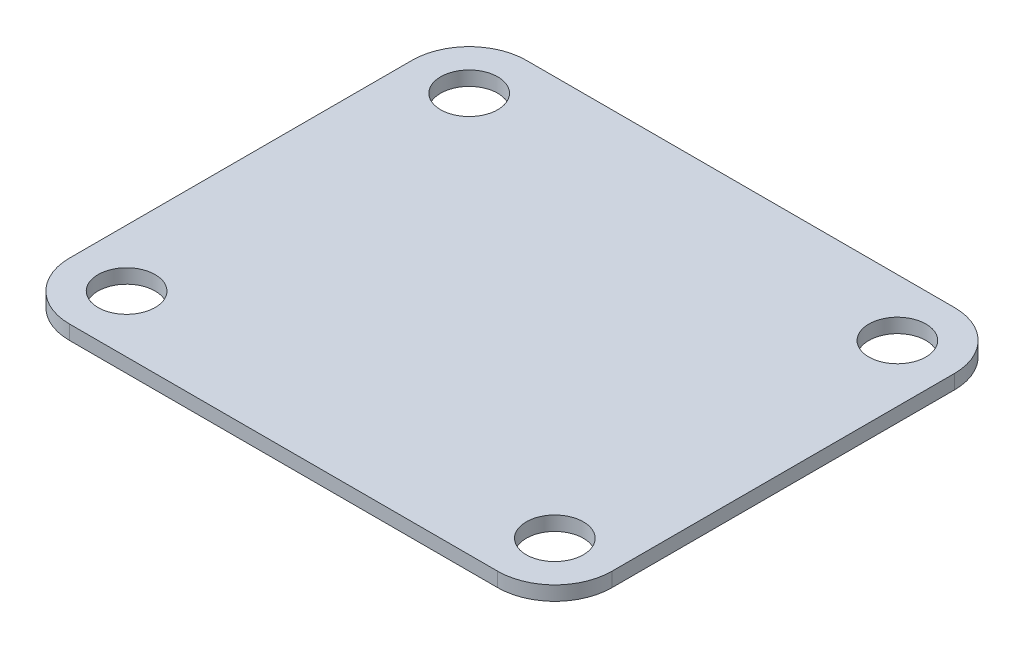
ISO-10303-21;
HEADER;
FILE_DESCRIPTION(('STEP AP214'),'2;1');
FILE_NAME('part.step','',(''),(''),'','','');
FILE_SCHEMA(('AUTOMOTIVE_DESIGN { 1 0 10303 214 1 1 1 1 }'));
ENDSEC;
DATA;
#1=APPLICATION_CONTEXT('core data for automotive mechanical design processes');
#2=APPLICATION_PROTOCOL_DEFINITION('international standard','automotive_design',2000,#1);
#3=PRODUCT_CONTEXT('',#1,'mechanical');
#4=PRODUCT('Part','Part','',(#3));
#5=PRODUCT_RELATED_PRODUCT_CATEGORY('part','',(#4));
#6=PRODUCT_DEFINITION_FORMATION('','',#4);
#7=PRODUCT_DEFINITION_CONTEXT('part definition',#1,'design');
#8=PRODUCT_DEFINITION('design','',#6,#7);
#9=PRODUCT_DEFINITION_SHAPE('','',#8);
#10=(LENGTH_UNIT() NAMED_UNIT(*) SI_UNIT(.MILLI.,.METRE.));
#11=(NAMED_UNIT(*) PLANE_ANGLE_UNIT() SI_UNIT($,.RADIAN.));
#12=(NAMED_UNIT(*) SI_UNIT($,.STERADIAN.) SOLID_ANGLE_UNIT());
#13=UNCERTAINTY_MEASURE_WITH_UNIT(LENGTH_MEASURE(1.E-05),#10,'distance_accuracy_value','');
#14=(GEOMETRIC_REPRESENTATION_CONTEXT(3) GLOBAL_UNCERTAINTY_ASSIGNED_CONTEXT((#13)) GLOBAL_UNIT_ASSIGNED_CONTEXT((#10,
#11,#12)) REPRESENTATION_CONTEXT('',''));
#15=CARTESIAN_POINT('',(0.,0.,0.));
#16=DIRECTION('',(0.,0.,1.));
#17=DIRECTION('',(1.,0.,0.));
#18=AXIS2_PLACEMENT_3D('',#15,#16,#17);
#19=CARTESIAN_POINT('',(0.,1.,0.));
#20=DIRECTION('',(0.,1.,0.));
#21=DIRECTION('',(0.,0.,1.));
#22=AXIS2_PLACEMENT_3D('',#19,#20,#21);
#23=PLANE('',#22);
#24=CARTESIAN_POINT('',(15.,1.,12.));
#25=DIRECTION('',(0.,1.,0.));
#26=DIRECTION('',(0.,0.,1.));
#27=AXIS2_PLACEMENT_3D('',#24,#25,#26);
#28=CIRCLE('',#27,2.);
#29=CARTESIAN_POINT('',(15.,1.,14.));
#30=VERTEX_POINT('',#29);
#31=EDGE_CURVE('E215',#30,#30,#28,.T.);
#32=ORIENTED_EDGE('',*,*,#31,.F.);
#33=EDGE_LOOP('',(#32));
#34=FACE_BOUND('',#33,.T.);
#35=CARTESIAN_POINT('',(-15.,1.,-12.));
#36=DIRECTION('',(0.,1.,0.));
#37=DIRECTION('',(0.,0.,1.));
#38=AXIS2_PLACEMENT_3D('',#35,#36,#37);
#39=CIRCLE('',#38,2.);
#40=CARTESIAN_POINT('',(-15.,1.,-10.));
#41=VERTEX_POINT('',#40);
#42=EDGE_CURVE('E130',#41,#41,#39,.T.);
#43=ORIENTED_EDGE('',*,*,#42,.F.);
#44=EDGE_LOOP('',(#43));
#45=FACE_BOUND('',#44,.T.);
#46=DIRECTION('',(-1.,0.,0.));
#47=VECTOR('',#46,1.);
#48=CARTESIAN_POINT('',(19.,1.,-16.));
#49=LINE('',#48,#47);
#50=CARTESIAN_POINT('',(15.,1.,-16.));
#51=VERTEX_POINT('',#50);
#52=CARTESIAN_POINT('',(-15.,1.,-16.));
#53=VERTEX_POINT('',#52);
#54=EDGE_CURVE('E139',#51,#53,#49,.T.);
#55=ORIENTED_EDGE('',*,*,#54,.T.);
#56=CARTESIAN_POINT('',(-15.,1.,-12.));
#57=DIRECTION('',(0.,1.,0.));
#58=DIRECTION('',(0.,0.,1.));
#59=AXIS2_PLACEMENT_3D('',#56,#57,#58);
#60=CIRCLE('',#59,4.);
#61=CARTESIAN_POINT('',(-19.,1.,-12.));
#62=VERTEX_POINT('',#61);
#63=EDGE_CURVE('E158',#53,#62,#60,.T.);
#64=ORIENTED_EDGE('',*,*,#63,.T.);
#65=DIRECTION('',(0.,0.,1.));
#66=VECTOR('',#65,1.);
#67=CARTESIAN_POINT('',(-19.,1.,16.));
#68=LINE('',#67,#66);
#69=CARTESIAN_POINT('',(-19.,1.,12.));
#70=VERTEX_POINT('',#69);
#71=EDGE_CURVE('E122',#62,#70,#68,.T.);
#72=ORIENTED_EDGE('',*,*,#71,.T.);
#73=CARTESIAN_POINT('',(-15.,1.,12.));
#74=DIRECTION('',(0.,1.,0.));
#75=DIRECTION('',(0.,0.,1.));
#76=AXIS2_PLACEMENT_3D('',#73,#74,#75);
#77=CIRCLE('',#76,4.);
#78=CARTESIAN_POINT('',(-15.,1.,16.));
#79=VERTEX_POINT('',#78);
#80=EDGE_CURVE('E153',#70,#79,#77,.T.);
#81=ORIENTED_EDGE('',*,*,#80,.T.);
#82=DIRECTION('',(1.,0.,0.));
#83=VECTOR('',#82,1.);
#84=CARTESIAN_POINT('',(19.,1.,16.));
#85=LINE('',#84,#83);
#86=CARTESIAN_POINT('',(15.,1.,16.));
#87=VERTEX_POINT('',#86);
#88=EDGE_CURVE('E229',#79,#87,#85,.T.);
#89=ORIENTED_EDGE('',*,*,#88,.T.);
#90=CARTESIAN_POINT('',(15.,1.,12.));
#91=DIRECTION('',(0.,1.,0.));
#92=DIRECTION('',(0.,0.,1.));
#93=AXIS2_PLACEMENT_3D('',#90,#91,#92);
#94=CIRCLE('',#93,4.);
#95=CARTESIAN_POINT('',(19.,1.,12.));
#96=VERTEX_POINT('',#95);
#97=EDGE_CURVE('E57',#87,#96,#94,.T.);
#98=ORIENTED_EDGE('',*,*,#97,.T.);
#99=DIRECTION('',(0.,0.,-1.));
#100=VECTOR('',#99,1.);
#101=CARTESIAN_POINT('',(19.,1.,16.));
#102=LINE('',#101,#100);
#103=CARTESIAN_POINT('',(19.,1.,-12.));
#104=VERTEX_POINT('',#103);
#105=EDGE_CURVE('E230',#96,#104,#102,.T.);
#106=ORIENTED_EDGE('',*,*,#105,.T.);
#107=CARTESIAN_POINT('',(15.,1.,-12.));
#108=DIRECTION('',(0.,1.,0.));
#109=DIRECTION('',(0.,0.,1.));
#110=AXIS2_PLACEMENT_3D('',#107,#108,#109);
#111=CIRCLE('',#110,4.);
#112=EDGE_CURVE('E156',#104,#51,#111,.T.);
#113=ORIENTED_EDGE('',*,*,#112,.T.);
#114=EDGE_LOOP('',(#55,#64,#72,#81,#89,#98,#106,#113));
#115=FACE_BOUND('',#114,.T.);
#116=CARTESIAN_POINT('',(15.,1.,-12.));
#117=DIRECTION('',(0.,1.,0.));
#118=DIRECTION('',(0.,0.,-1.));
#119=AXIS2_PLACEMENT_3D('',#116,#117,#118);
#120=CIRCLE('',#119,2.);
#121=CARTESIAN_POINT('',(15.,1.,-14.));
#122=VERTEX_POINT('',#121);
#123=EDGE_CURVE('E221',#122,#122,#120,.T.);
#124=ORIENTED_EDGE('',*,*,#123,.F.);
#125=EDGE_LOOP('',(#124));
#126=FACE_BOUND('',#125,.T.);
#127=CARTESIAN_POINT('',(-15.,1.,12.));
#128=DIRECTION('',(0.,1.,0.));
#129=DIRECTION('',(0.,0.,-1.));
#130=AXIS2_PLACEMENT_3D('',#127,#128,#129);
#131=CIRCLE('',#130,2.);
#132=CARTESIAN_POINT('',(-15.,1.,9.99999999999999));
#133=VERTEX_POINT('',#132);
#134=EDGE_CURVE('E209',#133,#133,#131,.T.);
#135=ORIENTED_EDGE('',*,*,#134,.F.);
#136=EDGE_LOOP('',(#135));
#137=FACE_BOUND('',#136,.T.);
#138=ADVANCED_FACE('F35',(#34,#45,#115,#126,#137),#23,.T.);
#139=CARTESIAN_POINT('',(0.,0.,0.));
#140=DIRECTION('',(0.,1.,0.));
#141=DIRECTION('',(0.,0.,1.));
#142=AXIS2_PLACEMENT_3D('',#139,#140,#141);
#143=PLANE('',#142);
#144=CARTESIAN_POINT('',(0.,0.,0.));
#145=DIRECTION('',(0.,1.,0.));
#146=DIRECTION('',(0.,0.,1.));
#147=AXIS2_PLACEMENT_3D('',#144,#145,#146);
#148=CIRCLE('',#147,15.);
#149=CARTESIAN_POINT('',(0.,0.,15.));
#150=VERTEX_POINT('',#149);
#151=EDGE_CURVE('E172',#150,#150,#148,.T.);
#152=ORIENTED_EDGE('',*,*,#151,.T.);
#153=EDGE_LOOP('',(#152));
#154=FACE_BOUND('',#153,.T.);
#155=DIRECTION('',(0.,0.,1.));
#156=VECTOR('',#155,1.);
#157=CARTESIAN_POINT('',(-19.,0.,16.));
#158=LINE('',#157,#156);
#159=CARTESIAN_POINT('',(-19.,0.,-12.));
#160=VERTEX_POINT('',#159);
#161=CARTESIAN_POINT('',(-19.,0.,12.));
#162=VERTEX_POINT('',#161);
#163=EDGE_CURVE('E119',#160,#162,#158,.T.);
#164=ORIENTED_EDGE('',*,*,#163,.F.);
#165=CARTESIAN_POINT('',(-15.,0.,-12.));
#166=DIRECTION('',(0.,1.,0.));
#167=DIRECTION('',(0.,0.,1.));
#168=AXIS2_PLACEMENT_3D('',#165,#166,#167);
#169=CIRCLE('',#168,4.);
#170=CARTESIAN_POINT('',(-15.,0.,-16.));
#171=VERTEX_POINT('',#170);
#172=EDGE_CURVE('E102',#160,#171,#169,.F.);
#173=ORIENTED_EDGE('',*,*,#172,.T.);
#174=DIRECTION('',(-1.,0.,0.));
#175=VECTOR('',#174,1.);
#176=CARTESIAN_POINT('',(19.,0.,-16.));
#177=LINE('',#176,#175);
#178=CARTESIAN_POINT('',(15.,0.,-16.));
#179=VERTEX_POINT('',#178);
#180=EDGE_CURVE('E143',#179,#171,#177,.T.);
#181=ORIENTED_EDGE('',*,*,#180,.F.);
#182=CARTESIAN_POINT('',(15.,0.,-12.));
#183=DIRECTION('',(0.,1.,0.));
#184=DIRECTION('',(0.,0.,1.));
#185=AXIS2_PLACEMENT_3D('',#182,#183,#184);
#186=CIRCLE('',#185,4.);
#187=CARTESIAN_POINT('',(19.,0.,-12.));
#188=VERTEX_POINT('',#187);
#189=EDGE_CURVE('E113',#179,#188,#186,.F.);
#190=ORIENTED_EDGE('',*,*,#189,.T.);
#191=DIRECTION('',(0.,0.,-1.));
#192=VECTOR('',#191,1.);
#193=CARTESIAN_POINT('',(19.,0.,16.));
#194=LINE('',#193,#192);
#195=CARTESIAN_POINT('',(19.,0.,12.));
#196=VERTEX_POINT('',#195);
#197=EDGE_CURVE('E133',#196,#188,#194,.T.);
#198=ORIENTED_EDGE('',*,*,#197,.F.);
#199=CARTESIAN_POINT('',(15.,0.,12.));
#200=DIRECTION('',(0.,1.,0.));
#201=DIRECTION('',(0.,0.,1.));
#202=AXIS2_PLACEMENT_3D('',#199,#200,#201);
#203=CIRCLE('',#202,4.);
#204=CARTESIAN_POINT('',(15.,0.,16.));
#205=VERTEX_POINT('',#204);
#206=EDGE_CURVE('E147',#196,#205,#203,.F.);
#207=ORIENTED_EDGE('',*,*,#206,.T.);
#208=DIRECTION('',(1.,0.,0.));
#209=VECTOR('',#208,1.);
#210=CARTESIAN_POINT('',(19.,0.,16.));
#211=LINE('',#210,#209);
#212=CARTESIAN_POINT('',(-15.,0.,16.));
#213=VERTEX_POINT('',#212);
#214=EDGE_CURVE('E129',#213,#205,#211,.T.);
#215=ORIENTED_EDGE('',*,*,#214,.F.);
#216=CARTESIAN_POINT('',(-15.,0.,12.));
#217=DIRECTION('',(0.,1.,0.));
#218=DIRECTION('',(0.,0.,1.));
#219=AXIS2_PLACEMENT_3D('',#216,#217,#218);
#220=CIRCLE('',#219,4.);
#221=EDGE_CURVE('E123',#213,#162,#220,.F.);
#222=ORIENTED_EDGE('',*,*,#221,.T.);
#223=EDGE_LOOP('',(#164,#173,#181,#190,#198,#207,#215,#222));
#224=FACE_BOUND('',#223,.T.);
#225=CARTESIAN_POINT('',(-15.,0.,-12.));
#226=DIRECTION('',(0.,1.,0.));
#227=DIRECTION('',(0.,0.,1.));
#228=AXIS2_PLACEMENT_3D('',#225,#226,#227);
#229=CIRCLE('',#228,2.);
#230=CARTESIAN_POINT('',(-15.,0.,-10.));
#231=VERTEX_POINT('',#230);
#232=EDGE_CURVE('E136',#231,#231,#229,.T.);
#233=ORIENTED_EDGE('',*,*,#232,.T.);
#234=EDGE_LOOP('',(#233));
#235=FACE_BOUND('',#234,.T.);
#236=CARTESIAN_POINT('',(15.,0.,-12.));
#237=DIRECTION('',(0.,1.,0.));
#238=DIRECTION('',(0.,0.,-1.));
#239=AXIS2_PLACEMENT_3D('',#236,#237,#238);
#240=CIRCLE('',#239,2.);
#241=CARTESIAN_POINT('',(15.,0.,-14.));
#242=VERTEX_POINT('',#241);
#243=EDGE_CURVE('E218',#242,#242,#240,.T.);
#244=ORIENTED_EDGE('',*,*,#243,.T.);
#245=EDGE_LOOP('',(#244));
#246=FACE_BOUND('',#245,.T.);
#247=CARTESIAN_POINT('',(15.,0.,12.));
#248=DIRECTION('',(0.,1.,0.));
#249=DIRECTION('',(0.,0.,1.));
#250=AXIS2_PLACEMENT_3D('',#247,#248,#249);
#251=CIRCLE('',#250,2.);
#252=CARTESIAN_POINT('',(15.,0.,14.));
#253=VERTEX_POINT('',#252);
#254=EDGE_CURVE('E212',#253,#253,#251,.T.);
#255=ORIENTED_EDGE('',*,*,#254,.T.);
#256=EDGE_LOOP('',(#255));
#257=FACE_BOUND('',#256,.T.);
#258=CARTESIAN_POINT('',(-15.,0.,12.));
#259=DIRECTION('',(0.,1.,0.));
#260=DIRECTION('',(0.,0.,-1.));
#261=AXIS2_PLACEMENT_3D('',#258,#259,#260);
#262=CIRCLE('',#261,2.);
#263=CARTESIAN_POINT('',(-15.,0.,9.99999999999999));
#264=VERTEX_POINT('',#263);
#265=EDGE_CURVE('E208',#264,#264,#262,.T.);
#266=ORIENTED_EDGE('',*,*,#265,.T.);
#267=EDGE_LOOP('',(#266));
#268=FACE_BOUND('',#267,.T.);
#269=ADVANCED_FACE('F126',(#154,#224,#235,#246,#257,#268),#143,.F.);
#270=CARTESIAN_POINT('',(-19.,1.,16.));
#271=DIRECTION('',(1.,0.,0.));
#272=DIRECTION('',(0.,0.,-1.));
#273=AXIS2_PLACEMENT_3D('',#270,#271,#272);
#274=PLANE('',#273);
#275=ORIENTED_EDGE('',*,*,#71,.F.);
#276=DIRECTION('',(0.,-1.,0.));
#277=VECTOR('',#276,1.);
#278=CARTESIAN_POINT('',(-19.,1.,-12.));
#279=LINE('',#278,#277);
#280=EDGE_CURVE('E106',#62,#160,#279,.T.);
#281=ORIENTED_EDGE('',*,*,#280,.T.);
#282=ORIENTED_EDGE('',*,*,#163,.T.);
#283=DIRECTION('',(0.,-1.,0.));
#284=VECTOR('',#283,1.);
#285=CARTESIAN_POINT('',(-19.,1.,12.));
#286=LINE('',#285,#284);
#287=EDGE_CURVE('E124',#162,#70,#286,.F.);
#288=ORIENTED_EDGE('',*,*,#287,.T.);
#289=EDGE_LOOP('',(#275,#281,#282,#288));
#290=FACE_BOUND('',#289,.T.);
#291=ADVANCED_FACE('F118',(#290),#274,.F.);
#292=CARTESIAN_POINT('',(19.,1.,16.));
#293=DIRECTION('',(0.,0.,-1.));
#294=DIRECTION('',(-1.,0.,0.));
#295=AXIS2_PLACEMENT_3D('',#292,#293,#294);
#296=PLANE('',#295);
#297=ORIENTED_EDGE('',*,*,#214,.T.);
#298=DIRECTION('',(0.,-1.,0.));
#299=VECTOR('',#298,1.);
#300=CARTESIAN_POINT('',(15.,1.,16.));
#301=LINE('',#300,#299);
#302=EDGE_CURVE('E167',#205,#87,#301,.F.);
#303=ORIENTED_EDGE('',*,*,#302,.T.);
#304=ORIENTED_EDGE('',*,*,#88,.F.);
#305=DIRECTION('',(0.,-1.,0.));
#306=VECTOR('',#305,1.);
#307=CARTESIAN_POINT('',(-15.,1.,16.));
#308=LINE('',#307,#306);
#309=EDGE_CURVE('E164',#79,#213,#308,.T.);
#310=ORIENTED_EDGE('',*,*,#309,.T.);
#311=EDGE_LOOP('',(#297,#303,#304,#310));
#312=FACE_BOUND('',#311,.T.);
#313=ADVANCED_FACE('F247',(#312),#296,.F.);
#314=CARTESIAN_POINT('',(19.,1.,16.));
#315=DIRECTION('',(-1.,0.,0.));
#316=DIRECTION('',(0.,0.,1.));
#317=AXIS2_PLACEMENT_3D('',#314,#315,#316);
#318=PLANE('',#317);
#319=ORIENTED_EDGE('',*,*,#197,.T.);
#320=DIRECTION('',(0.,-1.,0.));
#321=VECTOR('',#320,1.);
#322=CARTESIAN_POINT('',(19.,1.,-12.));
#323=LINE('',#322,#321);
#324=EDGE_CURVE('E50',#188,#104,#323,.F.);
#325=ORIENTED_EDGE('',*,*,#324,.T.);
#326=ORIENTED_EDGE('',*,*,#105,.F.);
#327=DIRECTION('',(0.,-1.,0.));
#328=VECTOR('',#327,1.);
#329=CARTESIAN_POINT('',(19.,1.,12.));
#330=LINE('',#329,#328);
#331=EDGE_CURVE('E160',#96,#196,#330,.T.);
#332=ORIENTED_EDGE('',*,*,#331,.T.);
#333=EDGE_LOOP('',(#319,#325,#326,#332));
#334=FACE_BOUND('',#333,.T.);
#335=ADVANCED_FACE('F241',(#334),#318,.F.);
#336=CARTESIAN_POINT('',(19.,1.,-16.));
#337=DIRECTION('',(0.,0.,1.));
#338=DIRECTION('',(1.,0.,0.));
#339=AXIS2_PLACEMENT_3D('',#336,#337,#338);
#340=PLANE('',#339);
#341=ORIENTED_EDGE('',*,*,#180,.T.);
#342=DIRECTION('',(0.,-1.,0.));
#343=VECTOR('',#342,1.);
#344=CARTESIAN_POINT('',(-15.,1.,-16.));
#345=LINE('',#344,#343);
#346=EDGE_CURVE('E107',#171,#53,#345,.F.);
#347=ORIENTED_EDGE('',*,*,#346,.T.);
#348=ORIENTED_EDGE('',*,*,#54,.F.);
#349=DIRECTION('',(0.,-1.,0.));
#350=VECTOR('',#349,1.);
#351=CARTESIAN_POINT('',(15.,1.,-16.));
#352=LINE('',#351,#350);
#353=EDGE_CURVE('E112',#51,#179,#352,.T.);
#354=ORIENTED_EDGE('',*,*,#353,.T.);
#355=EDGE_LOOP('',(#341,#347,#348,#354));
#356=FACE_BOUND('',#355,.T.);
#357=ADVANCED_FACE('F237',(#356),#340,.F.);
#358=CARTESIAN_POINT('',(-15.,1.,-12.));
#359=DIRECTION('',(0.,-1.,0.));
#360=DIRECTION('',(0.,0.,-1.));
#361=AXIS2_PLACEMENT_3D('',#358,#359,#360);
#362=CYLINDRICAL_SURFACE('',#361,2.);
#363=ORIENTED_EDGE('',*,*,#42,.T.);
#364=EDGE_LOOP('',(#363));
#365=FACE_BOUND('',#364,.T.);
#366=ORIENTED_EDGE('',*,*,#232,.F.);
#367=EDGE_LOOP('',(#366));
#368=FACE_BOUND('',#367,.T.);
#369=ADVANCED_FACE('F276',(#365,#368),#362,.F.);
#370=CARTESIAN_POINT('',(15.,1.,-12.));
#371=DIRECTION('',(0.,-1.,0.));
#372=DIRECTION('',(0.,0.,-1.));
#373=AXIS2_PLACEMENT_3D('',#370,#371,#372);
#374=CYLINDRICAL_SURFACE('',#373,2.);
#375=ORIENTED_EDGE('',*,*,#123,.T.);
#376=EDGE_LOOP('',(#375));
#377=FACE_BOUND('',#376,.T.);
#378=ORIENTED_EDGE('',*,*,#243,.F.);
#379=EDGE_LOOP('',(#378));
#380=FACE_BOUND('',#379,.T.);
#381=ADVANCED_FACE('F432',(#377,#380),#374,.F.);
#382=CARTESIAN_POINT('',(15.,1.,12.));
#383=DIRECTION('',(0.,-1.,0.));
#384=DIRECTION('',(0.,0.,-1.));
#385=AXIS2_PLACEMENT_3D('',#382,#383,#384);
#386=CYLINDRICAL_SURFACE('',#385,2.);
#387=ORIENTED_EDGE('',*,*,#31,.T.);
#388=EDGE_LOOP('',(#387));
#389=FACE_BOUND('',#388,.T.);
#390=ORIENTED_EDGE('',*,*,#254,.F.);
#391=EDGE_LOOP('',(#390));
#392=FACE_BOUND('',#391,.T.);
#393=ADVANCED_FACE('F429',(#389,#392),#386,.F.);
#394=CARTESIAN_POINT('',(-15.,1.,12.));
#395=DIRECTION('',(0.,-1.,0.));
#396=DIRECTION('',(0.,0.,-1.));
#397=AXIS2_PLACEMENT_3D('',#394,#395,#396);
#398=CYLINDRICAL_SURFACE('',#397,2.);
#399=ORIENTED_EDGE('',*,*,#134,.T.);
#400=EDGE_LOOP('',(#399));
#401=FACE_BOUND('',#400,.T.);
#402=ORIENTED_EDGE('',*,*,#265,.F.);
#403=EDGE_LOOP('',(#402));
#404=FACE_BOUND('',#403,.T.);
#405=ADVANCED_FACE('F289',(#401,#404),#398,.F.);
#406=CARTESIAN_POINT('',(-15.,1.,-12.));
#407=DIRECTION('',(0.,-1.,0.));
#408=DIRECTION('',(0.,0.,-1.));
#409=AXIS2_PLACEMENT_3D('',#406,#407,#408);
#410=CYLINDRICAL_SURFACE('',#409,4.);
#411=ORIENTED_EDGE('',*,*,#63,.F.);
#412=ORIENTED_EDGE('',*,*,#346,.F.);
#413=ORIENTED_EDGE('',*,*,#172,.F.);
#414=ORIENTED_EDGE('',*,*,#280,.F.);
#415=EDGE_LOOP('',(#411,#412,#413,#414));
#416=FACE_BOUND('',#415,.T.);
#417=ADVANCED_FACE('F105',(#416),#410,.T.);
#418=CARTESIAN_POINT('',(15.,1.,-12.));
#419=DIRECTION('',(0.,-1.,0.));
#420=DIRECTION('',(0.,0.,-1.));
#421=AXIS2_PLACEMENT_3D('',#418,#419,#420);
#422=CYLINDRICAL_SURFACE('',#421,4.);
#423=ORIENTED_EDGE('',*,*,#112,.F.);
#424=ORIENTED_EDGE('',*,*,#324,.F.);
#425=ORIENTED_EDGE('',*,*,#189,.F.);
#426=ORIENTED_EDGE('',*,*,#353,.F.);
#427=EDGE_LOOP('',(#423,#424,#425,#426));
#428=FACE_BOUND('',#427,.T.);
#429=ADVANCED_FACE('F239',(#428),#422,.T.);
#430=CARTESIAN_POINT('',(15.,1.,12.));
#431=DIRECTION('',(0.,-1.,0.));
#432=DIRECTION('',(0.,0.,-1.));
#433=AXIS2_PLACEMENT_3D('',#430,#431,#432);
#434=CYLINDRICAL_SURFACE('',#433,4.);
#435=ORIENTED_EDGE('',*,*,#97,.F.);
#436=ORIENTED_EDGE('',*,*,#302,.F.);
#437=ORIENTED_EDGE('',*,*,#206,.F.);
#438=ORIENTED_EDGE('',*,*,#331,.F.);
#439=EDGE_LOOP('',(#435,#436,#437,#438));
#440=FACE_BOUND('',#439,.T.);
#441=ADVANCED_FACE('F244',(#440),#434,.T.);
#442=CARTESIAN_POINT('',(-15.,1.,12.));
#443=DIRECTION('',(0.,-1.,0.));
#444=DIRECTION('',(0.,0.,-1.));
#445=AXIS2_PLACEMENT_3D('',#442,#443,#444);
#446=CYLINDRICAL_SURFACE('',#445,4.);
#447=ORIENTED_EDGE('',*,*,#80,.F.);
#448=ORIENTED_EDGE('',*,*,#287,.F.);
#449=ORIENTED_EDGE('',*,*,#221,.F.);
#450=ORIENTED_EDGE('',*,*,#309,.F.);
#451=EDGE_LOOP('',(#447,#448,#449,#450));
#452=FACE_BOUND('',#451,.T.);
#453=ADVANCED_FACE('F252',(#452),#446,.T.);
#454=CARTESIAN_POINT('',(0.,-3.,0.));
#455=DIRECTION('',(0.,1.,0.));
#456=DIRECTION('',(0.,0.,1.));
#457=AXIS2_PLACEMENT_3D('',#454,#455,#456);
#458=CYLINDRICAL_SURFACE('',#457,13.);
#459=CARTESIAN_POINT('',(0.,-2.,0.));
#460=DIRECTION('',(0.,1.,0.));
#461=DIRECTION('',(0.,0.,1.));
#462=AXIS2_PLACEMENT_3D('',#459,#460,#461);
#463=CIRCLE('',#462,13.);
#464=CARTESIAN_POINT('',(0.,-2.,13.));
#465=VERTEX_POINT('',#464);
#466=EDGE_CURVE('E169',#465,#465,#463,.F.);
#467=ORIENTED_EDGE('',*,*,#466,.T.);
#468=EDGE_LOOP('',(#467));
#469=FACE_BOUND('',#468,.T.);
#470=CARTESIAN_POINT('',(0.,-3.,0.));
#471=DIRECTION('',(0.,-1.,0.));
#472=DIRECTION('',(0.,0.,-1.));
#473=AXIS2_PLACEMENT_3D('',#470,#471,#472);
#474=CIRCLE('',#473,13.);
#475=CARTESIAN_POINT('',(0.,-3.,-13.));
#476=VERTEX_POINT('',#475);
#477=EDGE_CURVE('E201',#476,#476,#474,.T.);
#478=ORIENTED_EDGE('',*,*,#477,.F.);
#479=EDGE_LOOP('',(#478));
#480=FACE_BOUND('',#479,.T.);
#481=ADVANCED_FACE('F254',(#469,#480),#458,.T.);
#482=CARTESIAN_POINT('',(0.,-3.,0.));
#483=DIRECTION('',(0.,-1.,0.));
#484=DIRECTION('',(0.,0.,-1.));
#485=AXIS2_PLACEMENT_3D('',#482,#483,#484);
#486=PLANE('',#485);
#487=CARTESIAN_POINT('',(0.,-3.,0.));
#488=DIRECTION('',(0.,-1.,0.));
#489=DIRECTION('',(0.,0.,-1.));
#490=AXIS2_PLACEMENT_3D('',#487,#488,#489);
#491=CIRCLE('',#490,12.);
#492=CARTESIAN_POINT('',(0.,-3.,-12.));
#493=VERTEX_POINT('',#492);
#494=EDGE_CURVE('E197',#493,#493,#491,.T.);
#495=ORIENTED_EDGE('',*,*,#494,.F.);
#496=EDGE_LOOP('',(#495));
#497=FACE_BOUND('',#496,.T.);
#498=ORIENTED_EDGE('',*,*,#477,.T.);
#499=EDGE_LOOP('',(#498));
#500=FACE_BOUND('',#499,.T.);
#501=ADVANCED_FACE('F260',(#497,#500),#486,.T.);
#502=CARTESIAN_POINT('',(0.,-1.,0.));
#503=DIRECTION('',(0.,-1.,0.));
#504=DIRECTION('',(0.,0.,-1.));
#505=AXIS2_PLACEMENT_3D('',#502,#503,#504);
#506=CYLINDRICAL_SURFACE('',#505,12.);
#507=CARTESIAN_POINT('',(0.,-2.,0.));
#508=DIRECTION('',(0.,-1.,0.));
#509=DIRECTION('',(0.,0.,-1.));
#510=AXIS2_PLACEMENT_3D('',#507,#508,#509);
#511=CIRCLE('',#510,12.);
#512=CARTESIAN_POINT('',(0.,-2.,-12.));
#513=VERTEX_POINT('',#512);
#514=EDGE_CURVE('E11',#513,#513,#511,.F.);
#515=ORIENTED_EDGE('',*,*,#514,.T.);
#516=EDGE_LOOP('',(#515));
#517=FACE_BOUND('',#516,.T.);
#518=ORIENTED_EDGE('',*,*,#494,.T.);
#519=EDGE_LOOP('',(#518));
#520=FACE_BOUND('',#519,.T.);
#521=ADVANCED_FACE('F314',(#517,#520),#506,.F.);
#522=CARTESIAN_POINT('',(0.,-1.,0.));
#523=DIRECTION('',(0.,-1.,0.));
#524=DIRECTION('',(0.,0.,-1.));
#525=AXIS2_PLACEMENT_3D('',#522,#523,#524);
#526=PLANE('',#525);
#527=CARTESIAN_POINT('',(0.,-1.,0.));
#528=DIRECTION('',(0.,-1.,0.));
#529=DIRECTION('',(0.,0.,-1.));
#530=AXIS2_PLACEMENT_3D('',#527,#528,#529);
#531=CIRCLE('',#530,7.);
#532=CARTESIAN_POINT('',(0.,-1.,-7.));
#533=VERTEX_POINT('',#532);
#534=EDGE_CURVE('E43',#533,#533,#531,.F.);
#535=ORIENTED_EDGE('',*,*,#534,.T.);
#536=EDGE_LOOP('',(#535));
#537=FACE_BOUND('',#536,.T.);
#538=CARTESIAN_POINT('',(0.,-1.,0.));
#539=DIRECTION('',(0.,-1.,0.));
#540=DIRECTION('',(0.,0.,-1.));
#541=AXIS2_PLACEMENT_3D('',#538,#539,#540);
#542=CIRCLE('',#541,11.);
#543=CARTESIAN_POINT('',(0.,-1.,-11.));
#544=VERTEX_POINT('',#543);
#545=EDGE_CURVE('E181',#544,#544,#542,.T.);
#546=ORIENTED_EDGE('',*,*,#545,.T.);
#547=EDGE_LOOP('',(#546));
#548=FACE_BOUND('',#547,.T.);
#549=ADVANCED_FACE('F186',(#537,#548),#526,.T.);
#550=CARTESIAN_POINT('',(0.,-2.,0.));
#551=DIRECTION('',(0.,1.,0.));
#552=DIRECTION('',(0.,0.,1.));
#553=AXIS2_PLACEMENT_3D('',#550,#551,#552);
#554=TOROIDAL_SURFACE('',#553,15.,2.);
#555=ORIENTED_EDGE('',*,*,#151,.F.);
#556=EDGE_LOOP('',(#555));
#557=FACE_BOUND('',#556,.T.);
#558=ORIENTED_EDGE('',*,*,#466,.F.);
#559=EDGE_LOOP('',(#558));
#560=FACE_BOUND('',#559,.T.);
#561=ADVANCED_FACE('F336',(#557,#560),#554,.F.);
#562=CARTESIAN_POINT('',(0.,0.,0.));
#563=DIRECTION('',(0.,-1.,0.));
#564=DIRECTION('',(0.,0.,-1.));
#565=AXIS2_PLACEMENT_3D('',#562,#563,#564);
#566=PLANE('',#565);
#567=CARTESIAN_POINT('',(0.,0.,0.));
#568=DIRECTION('',(0.,-1.,0.));
#569=DIRECTION('',(0.,0.,-1.));
#570=AXIS2_PLACEMENT_3D('',#567,#568,#569);
#571=CIRCLE('',#570,5.);
#572=CARTESIAN_POINT('',(0.,0.,-5.));
#573=VERTEX_POINT('',#572);
#574=EDGE_CURVE('E198',#573,#573,#571,.T.);
#575=ORIENTED_EDGE('',*,*,#574,.F.);
#576=EDGE_LOOP('',(#575));
#577=FACE_BOUND('',#576,.T.);
#578=CARTESIAN_POINT('',(0.,0.,0.));
#579=DIRECTION('',(0.,-1.,0.));
#580=DIRECTION('',(0.,0.,-1.));
#581=AXIS2_PLACEMENT_3D('',#578,#579,#580);
#582=CIRCLE('',#581,6.);
#583=CARTESIAN_POINT('',(0.,0.,-6.));
#584=VERTEX_POINT('',#583);
#585=EDGE_CURVE('E195',#584,#584,#582,.T.);
#586=ORIENTED_EDGE('',*,*,#585,.T.);
#587=EDGE_LOOP('',(#586));
#588=FACE_BOUND('',#587,.T.);
#589=ADVANCED_FACE('F341',(#577,#588),#566,.T.);
#590=CARTESIAN_POINT('',(0.,-2.,0.));
#591=DIRECTION('',(0.,1.,0.));
#592=DIRECTION('',(0.,0.,1.));
#593=AXIS2_PLACEMENT_3D('',#590,#591,#592);
#594=CYLINDRICAL_SURFACE('',#593,5.);
#595=CARTESIAN_POINT('',(0.,-1.,0.));
#596=DIRECTION('',(0.,-1.,0.));
#597=DIRECTION('',(0.,0.,-1.));
#598=AXIS2_PLACEMENT_3D('',#595,#596,#597);
#599=CIRCLE('',#598,5.);
#600=CARTESIAN_POINT('',(0.,-1.,-5.));
#601=VERTEX_POINT('',#600);
#602=EDGE_CURVE('E178',#601,#601,#599,.F.);
#603=ORIENTED_EDGE('',*,*,#602,.T.);
#604=EDGE_LOOP('',(#603));
#605=FACE_BOUND('',#604,.T.);
#606=ORIENTED_EDGE('',*,*,#574,.T.);
#607=EDGE_LOOP('',(#606));
#608=FACE_BOUND('',#607,.T.);
#609=ADVANCED_FACE('F352',(#605,#608),#594,.T.);
#610=CARTESIAN_POINT('',(0.,-2.,0.));
#611=DIRECTION('',(0.,-1.,0.));
#612=DIRECTION('',(0.,0.,-1.));
#613=AXIS2_PLACEMENT_3D('',#610,#611,#612);
#614=PLANE('',#613);
#615=CARTESIAN_POINT('',(0.,-2.,0.));
#616=DIRECTION('',(0.,-1.,0.));
#617=DIRECTION('',(0.,0.,-1.));
#618=AXIS2_PLACEMENT_3D('',#615,#616,#617);
#619=CIRCLE('',#618,4.);
#620=CARTESIAN_POINT('',(0.,-2.,-4.));
#621=VERTEX_POINT('',#620);
#622=EDGE_CURVE('E175',#621,#621,#619,.T.);
#623=ORIENTED_EDGE('',*,*,#622,.T.);
#624=EDGE_LOOP('',(#623));
#625=FACE_BOUND('',#624,.T.);
#626=ADVANCED_FACE('F377',(#625),#614,.T.);
#627=CARTESIAN_POINT('',(0.,-1.,0.));
#628=DIRECTION('',(0.,-1.,0.));
#629=DIRECTION('',(0.,0.,-1.));
#630=AXIS2_PLACEMENT_3D('',#627,#628,#629);
#631=TOROIDAL_SURFACE('',#630,4.,1.);
#632=ORIENTED_EDGE('',*,*,#602,.F.);
#633=EDGE_LOOP('',(#632));
#634=FACE_BOUND('',#633,.T.);
#635=ORIENTED_EDGE('',*,*,#622,.F.);
#636=EDGE_LOOP('',(#635));
#637=FACE_BOUND('',#636,.T.);
#638=ADVANCED_FACE('F192',(#634,#637),#631,.T.);
#639=CARTESIAN_POINT('',(0.,0.,0.));
#640=DIRECTION('',(0.,-1.,0.));
#641=DIRECTION('',(0.,0.,-1.));
#642=AXIS2_PLACEMENT_3D('',#639,#640,#641);
#643=TOROIDAL_SURFACE('',#642,7.,1.);
#644=ORIENTED_EDGE('',*,*,#534,.F.);
#645=EDGE_LOOP('',(#644));
#646=FACE_BOUND('',#645,.T.);
#647=ORIENTED_EDGE('',*,*,#585,.F.);
#648=EDGE_LOOP('',(#647));
#649=FACE_BOUND('',#648,.T.);
#650=ADVANCED_FACE('F189',(#646,#649),#643,.T.);
#651=CARTESIAN_POINT('',(0.,-2.,0.));
#652=DIRECTION('',(0.,-1.,0.));
#653=DIRECTION('',(0.,0.,-1.));
#654=AXIS2_PLACEMENT_3D('',#651,#652,#653);
#655=TOROIDAL_SURFACE('',#654,11.,1.);
#656=ORIENTED_EDGE('',*,*,#514,.F.);
#657=EDGE_LOOP('',(#656));
#658=FACE_BOUND('',#657,.T.);
#659=ORIENTED_EDGE('',*,*,#545,.F.);
#660=EDGE_LOOP('',(#659));
#661=FACE_BOUND('',#660,.T.);
#662=ADVANCED_FACE('F37',(#658,#661),#655,.F.);
#663=CLOSED_SHELL('',(#138,#269,#291,#313,#335,#357,#369,#381,#393,#405,#417,#429,#441,#453,
#481,#501,#521,#549,#561,#589,#609,#626,#638,#650,#662));
#664=MANIFOLD_SOLID_BREP('B2',#663);
#665=ADVANCED_BREP_SHAPE_REPRESENTATION('',(#18,#664),#14);
#666=SHAPE_DEFINITION_REPRESENTATION(#9,#665);
ENDSEC;
END-ISO-10303-21;
